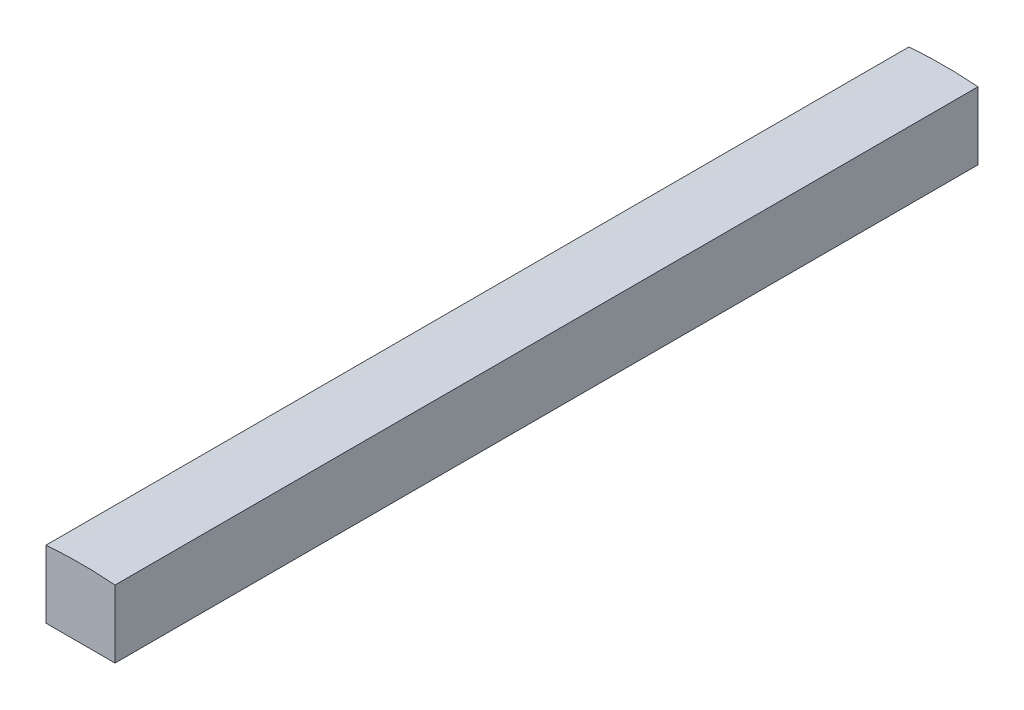
ISO-10303-21;
HEADER;
FILE_DESCRIPTION(('STEP AP214'),'2;1');
FILE_NAME('part.step','',(''),(''),'','','');
FILE_SCHEMA(('AUTOMOTIVE_DESIGN { 1 0 10303 214 1 1 1 1 }'));
ENDSEC;
DATA;
#1=APPLICATION_CONTEXT('core data for automotive mechanical design processes');
#2=APPLICATION_PROTOCOL_DEFINITION('international standard','automotive_design',2000,#1);
#3=PRODUCT_CONTEXT('',#1,'mechanical');
#4=PRODUCT('Part','Part','',(#3));
#5=PRODUCT_RELATED_PRODUCT_CATEGORY('part','',(#4));
#6=PRODUCT_DEFINITION_FORMATION('','',#4);
#7=PRODUCT_DEFINITION_CONTEXT('part definition',#1,'design');
#8=PRODUCT_DEFINITION('design','',#6,#7);
#9=PRODUCT_DEFINITION_SHAPE('','',#8);
#10=(LENGTH_UNIT() NAMED_UNIT(*) SI_UNIT(.MILLI.,.METRE.));
#11=(NAMED_UNIT(*) PLANE_ANGLE_UNIT() SI_UNIT($,.RADIAN.));
#12=(NAMED_UNIT(*) SI_UNIT($,.STERADIAN.) SOLID_ANGLE_UNIT());
#13=UNCERTAINTY_MEASURE_WITH_UNIT(LENGTH_MEASURE(1.E-05),#10,'distance_accuracy_value','');
#14=(GEOMETRIC_REPRESENTATION_CONTEXT(3) GLOBAL_UNCERTAINTY_ASSIGNED_CONTEXT((#13)) GLOBAL_UNIT_ASSIGNED_CONTEXT((#10,
#11,#12)) REPRESENTATION_CONTEXT('',''));
#15=CARTESIAN_POINT('',(0.,0.,0.));
#16=DIRECTION('',(0.,0.,1.));
#17=DIRECTION('',(1.,0.,0.));
#18=AXIS2_PLACEMENT_3D('',#15,#16,#17);
#19=CARTESIAN_POINT('',(20.,206.,500.));
#20=DIRECTION('',(-1.,0.,0.));
#21=DIRECTION('',(0.,0.,1.));
#22=AXIS2_PLACEMENT_3D('',#19,#20,#21);
#23=PLANE('',#22);
#24=DIRECTION('',(0.,1.,0.));
#25=VECTOR('',#24,1.);
#26=CARTESIAN_POINT('',(20.,206.,0.));
#27=LINE('',#26,#25);
#28=CARTESIAN_POINT('',(20.,206.,0.));
#29=VERTEX_POINT('',#28);
#30=CARTESIAN_POINT('',(20.,245.18564395168,0.));
#31=VERTEX_POINT('',#30);
#32=EDGE_CURVE('E106',#29,#31,#27,.T.);
#33=ORIENTED_EDGE('',*,*,#32,.T.);
#34=DIRECTION('',(0.,0.,-1.));
#35=VECTOR('',#34,1.);
#36=CARTESIAN_POINT('',(20.,245.18564395168,500.));
#37=LINE('',#36,#35);
#38=CARTESIAN_POINT('',(20.,245.18564395168,500.));
#39=VERTEX_POINT('',#38);
#40=EDGE_CURVE('E11',#39,#31,#37,.T.);
#41=ORIENTED_EDGE('',*,*,#40,.F.);
#42=DIRECTION('',(0.,1.,0.));
#43=VECTOR('',#42,1.);
#44=CARTESIAN_POINT('',(20.,206.,500.));
#45=LINE('',#44,#43);
#46=CARTESIAN_POINT('',(20.,206.,500.));
#47=VERTEX_POINT('',#46);
#48=EDGE_CURVE('E87',#47,#39,#45,.T.);
#49=ORIENTED_EDGE('',*,*,#48,.F.);
#50=DIRECTION('',(0.,0.,-1.));
#51=VECTOR('',#50,1.);
#52=CARTESIAN_POINT('',(20.,206.,500.));
#53=LINE('',#52,#51);
#54=EDGE_CURVE('E102',#47,#29,#53,.T.);
#55=ORIENTED_EDGE('',*,*,#54,.T.);
#56=EDGE_LOOP('',(#33,#41,#49,#55));
#57=FACE_BOUND('',#56,.T.);
#58=ADVANCED_FACE('F39',(#57),#23,.F.);
#59=CARTESIAN_POINT('',(0.,0.,500.));
#60=DIRECTION('',(0.,0.,-1.));
#61=DIRECTION('',(-1.,0.,0.));
#62=AXIS2_PLACEMENT_3D('',#59,#60,#61);
#63=CYLINDRICAL_SURFACE('',#62,246.);
#64=CARTESIAN_POINT('',(0.,0.,0.));
#65=DIRECTION('',(0.,0.,1.));
#66=DIRECTION('',(1.,0.,0.));
#67=AXIS2_PLACEMENT_3D('',#64,#65,#66);
#68=CIRCLE('',#67,246.);
#69=CARTESIAN_POINT('',(-20.,245.18564395168,0.));
#70=VERTEX_POINT('',#69);
#71=EDGE_CURVE('E93',#31,#70,#68,.T.);
#72=ORIENTED_EDGE('',*,*,#71,.T.);
#73=DIRECTION('',(0.,0.,-1.));
#74=VECTOR('',#73,1.);
#75=CARTESIAN_POINT('',(-20.,245.18564395168,500.));
#76=LINE('',#75,#74);
#77=CARTESIAN_POINT('',(-20.,245.18564395168,500.));
#78=VERTEX_POINT('',#77);
#79=EDGE_CURVE('E48',#78,#70,#76,.T.);
#80=ORIENTED_EDGE('',*,*,#79,.F.);
#81=CARTESIAN_POINT('',(0.,0.,500.));
#82=DIRECTION('',(0.,0.,1.));
#83=DIRECTION('',(1.,0.,0.));
#84=AXIS2_PLACEMENT_3D('',#81,#82,#83);
#85=CIRCLE('',#84,246.);
#86=EDGE_CURVE('E82',#39,#78,#85,.T.);
#87=ORIENTED_EDGE('',*,*,#86,.F.);
#88=ORIENTED_EDGE('',*,*,#40,.T.);
#89=EDGE_LOOP('',(#72,#80,#87,#88));
#90=FACE_BOUND('',#89,.T.);
#91=ADVANCED_FACE('F92',(#90),#63,.T.);
#92=CARTESIAN_POINT('',(-20.,206.,500.));
#93=DIRECTION('',(-1.,0.,0.));
#94=DIRECTION('',(0.,0.,1.));
#95=AXIS2_PLACEMENT_3D('',#92,#93,#94);
#96=PLANE('',#95);
#97=DIRECTION('',(0.,1.,0.));
#98=VECTOR('',#97,1.);
#99=CARTESIAN_POINT('',(-20.,206.,0.));
#100=LINE('',#99,#98);
#101=CARTESIAN_POINT('',(-20.,206.,0.));
#102=VERTEX_POINT('',#101);
#103=EDGE_CURVE('E112',#102,#70,#100,.T.);
#104=ORIENTED_EDGE('',*,*,#103,.F.);
#105=DIRECTION('',(0.,0.,-1.));
#106=VECTOR('',#105,1.);
#107=CARTESIAN_POINT('',(-20.,206.,500.));
#108=LINE('',#107,#106);
#109=CARTESIAN_POINT('',(-20.,206.,500.));
#110=VERTEX_POINT('',#109);
#111=EDGE_CURVE('E72',#110,#102,#108,.T.);
#112=ORIENTED_EDGE('',*,*,#111,.F.);
#113=DIRECTION('',(0.,1.,0.));
#114=VECTOR('',#113,1.);
#115=CARTESIAN_POINT('',(-20.,206.,500.));
#116=LINE('',#115,#114);
#117=EDGE_CURVE('E85',#110,#78,#116,.T.);
#118=ORIENTED_EDGE('',*,*,#117,.T.);
#119=ORIENTED_EDGE('',*,*,#79,.T.);
#120=EDGE_LOOP('',(#104,#112,#118,#119));
#121=FACE_BOUND('',#120,.T.);
#122=ADVANCED_FACE('F98',(#121),#96,.T.);
#123=CARTESIAN_POINT('',(-20.,206.,500.));
#124=DIRECTION('',(0.,1.,0.));
#125=DIRECTION('',(0.,0.,1.));
#126=AXIS2_PLACEMENT_3D('',#123,#124,#125);
#127=PLANE('',#126);
#128=DIRECTION('',(1.,0.,0.));
#129=VECTOR('',#128,1.);
#130=CARTESIAN_POINT('',(-20.,206.,0.));
#131=LINE('',#130,#129);
#132=EDGE_CURVE('E75',#102,#29,#131,.T.);
#133=ORIENTED_EDGE('',*,*,#132,.T.);
#134=ORIENTED_EDGE('',*,*,#54,.F.);
#135=DIRECTION('',(1.,0.,0.));
#136=VECTOR('',#135,1.);
#137=CARTESIAN_POINT('',(-20.,206.,500.));
#138=LINE('',#137,#136);
#139=EDGE_CURVE('E56',#110,#47,#138,.T.);
#140=ORIENTED_EDGE('',*,*,#139,.F.);
#141=ORIENTED_EDGE('',*,*,#111,.T.);
#142=EDGE_LOOP('',(#133,#134,#140,#141));
#143=FACE_BOUND('',#142,.T.);
#144=ADVANCED_FACE('F129',(#143),#127,.F.);
#145=CARTESIAN_POINT('',(0.,0.,500.));
#146=DIRECTION('',(0.,0.,1.));
#147=DIRECTION('',(1.,0.,0.));
#148=AXIS2_PLACEMENT_3D('',#145,#146,#147);
#149=PLANE('',#148);
#150=ORIENTED_EDGE('',*,*,#48,.T.);
#151=ORIENTED_EDGE('',*,*,#86,.T.);
#152=ORIENTED_EDGE('',*,*,#117,.F.);
#153=ORIENTED_EDGE('',*,*,#139,.T.);
#154=EDGE_LOOP('',(#150,#151,#152,#153));
#155=FACE_BOUND('',#154,.T.);
#156=ADVANCED_FACE('F83',(#155),#149,.T.);
#157=CARTESIAN_POINT('',(0.,0.,0.));
#158=DIRECTION('',(0.,0.,1.));
#159=DIRECTION('',(1.,0.,0.));
#160=AXIS2_PLACEMENT_3D('',#157,#158,#159);
#161=PLANE('',#160);
#162=ORIENTED_EDGE('',*,*,#32,.F.);
#163=ORIENTED_EDGE('',*,*,#132,.F.);
#164=ORIENTED_EDGE('',*,*,#103,.T.);
#165=ORIENTED_EDGE('',*,*,#71,.F.);
#166=EDGE_LOOP('',(#162,#163,#164,#165));
#167=FACE_BOUND('',#166,.T.);
#168=ADVANCED_FACE('F123',(#167),#161,.F.);
#169=CLOSED_SHELL('',(#58,#91,#122,#144,#156,#168));
#170=MANIFOLD_SOLID_BREP('B2',#169);
#171=ADVANCED_BREP_SHAPE_REPRESENTATION('',(#18,#170),#14);
#172=SHAPE_DEFINITION_REPRESENTATION(#9,#171);
ENDSEC;
END-ISO-10303-21;
